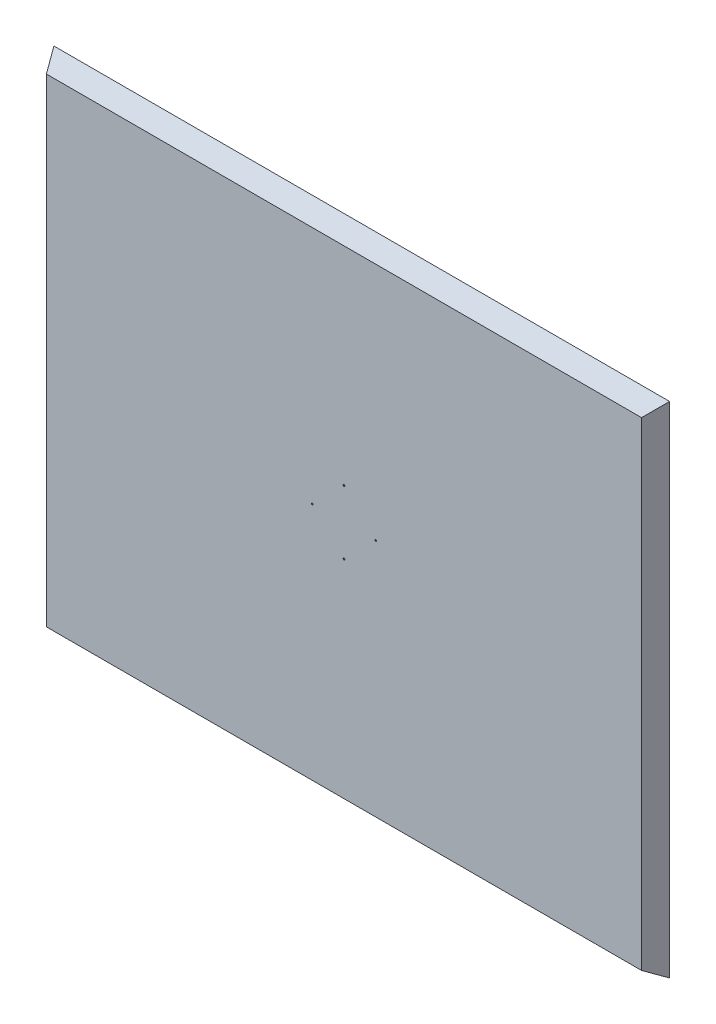
ISO-10303-21;
HEADER;
FILE_DESCRIPTION(('STEP AP214'),'2;1');
FILE_NAME('part.step','',(''),(''),'','','');
FILE_SCHEMA(('AUTOMOTIVE_DESIGN { 1 0 10303 214 1 1 1 1 }'));
ENDSEC;
DATA;
#1=APPLICATION_CONTEXT('core data for automotive mechanical design processes');
#2=APPLICATION_PROTOCOL_DEFINITION('international standard','automotive_design',2000,#1);
#3=PRODUCT_CONTEXT('',#1,'mechanical');
#4=PRODUCT('Part','Part','',(#3));
#5=PRODUCT_RELATED_PRODUCT_CATEGORY('part','',(#4));
#6=PRODUCT_DEFINITION_FORMATION('','',#4);
#7=PRODUCT_DEFINITION_CONTEXT('part definition',#1,'design');
#8=PRODUCT_DEFINITION('design','',#6,#7);
#9=PRODUCT_DEFINITION_SHAPE('','',#8);
#10=(LENGTH_UNIT() NAMED_UNIT(*) SI_UNIT(.MILLI.,.METRE.));
#11=(NAMED_UNIT(*) PLANE_ANGLE_UNIT() SI_UNIT($,.RADIAN.));
#12=(NAMED_UNIT(*) SI_UNIT($,.STERADIAN.) SOLID_ANGLE_UNIT());
#13=UNCERTAINTY_MEASURE_WITH_UNIT(LENGTH_MEASURE(1.E-05),#10,'distance_accuracy_value','');
#14=(GEOMETRIC_REPRESENTATION_CONTEXT(3) GLOBAL_UNCERTAINTY_ASSIGNED_CONTEXT((#13)) GLOBAL_UNIT_ASSIGNED_CONTEXT((#10,
#11,#12)) REPRESENTATION_CONTEXT('',''));
#15=CARTESIAN_POINT('',(0.,0.,0.));
#16=DIRECTION('',(0.,0.,1.));
#17=DIRECTION('',(1.,0.,0.));
#18=AXIS2_PLACEMENT_3D('',#15,#16,#17);
#19=CARTESIAN_POINT('',(0.,-89.415,-2181.47302049345));
#20=DIRECTION('',(0.,0.,1.));
#21=DIRECTION('',(0.,-1.,0.));
#22=AXIS2_PLACEMENT_3D('',#19,#20,#21);
#23=CYLINDRICAL_SURFACE('',#22,2.5);
#24=CARTESIAN_POINT('',(0.,-89.415,48.));
#25=DIRECTION('',(0.,0.,1.));
#26=DIRECTION('',(0.,-1.,0.));
#27=AXIS2_PLACEMENT_3D('',#24,#25,#26);
#28=CIRCLE('',#27,2.5);
#29=CARTESIAN_POINT('',(0.,-91.915,48.));
#30=VERTEX_POINT('',#29);
#31=EDGE_CURVE('E26',#30,#30,#28,.T.);
#32=ORIENTED_EDGE('',*,*,#31,.F.);
#33=EDGE_LOOP('',(#32));
#34=FACE_BOUND('',#33,.T.);
#35=CARTESIAN_POINT('',(0.,-89.415,50.));
#36=DIRECTION('',(0.,0.,1.));
#37=DIRECTION('',(1.,0.,0.));
#38=AXIS2_PLACEMENT_3D('',#35,#36,#37);
#39=CIRCLE('',#38,2.5);
#40=CARTESIAN_POINT('',(2.49999999999998,-89.415,50.));
#41=VERTEX_POINT('',#40);
#42=EDGE_CURVE('E11',#41,#41,#39,.T.);
#43=ORIENTED_EDGE('',*,*,#42,.T.);
#44=EDGE_LOOP('',(#43));
#45=FACE_BOUND('',#44,.T.);
#46=ADVANCED_FACE('F18',(#34,#45),#23,.F.);
#47=CARTESIAN_POINT('',(-89.415,0.,-2181.47302049345));
#48=DIRECTION('',(0.,0.,1.));
#49=DIRECTION('',(-1.,0.,0.));
#50=AXIS2_PLACEMENT_3D('',#47,#48,#49);
#51=CYLINDRICAL_SURFACE('',#50,2.5);
#52=CARTESIAN_POINT('',(-89.415,0.,48.));
#53=DIRECTION('',(0.,0.,1.));
#54=DIRECTION('',(-1.,0.,0.));
#55=AXIS2_PLACEMENT_3D('',#52,#53,#54);
#56=CIRCLE('',#55,2.5);
#57=CARTESIAN_POINT('',(-91.915,0.,48.));
#58=VERTEX_POINT('',#57);
#59=EDGE_CURVE('E94',#58,#58,#56,.T.);
#60=ORIENTED_EDGE('',*,*,#59,.F.);
#61=EDGE_LOOP('',(#60));
#62=FACE_BOUND('',#61,.T.);
#63=CARTESIAN_POINT('',(-89.415,0.,50.));
#64=DIRECTION('',(0.,0.,1.));
#65=DIRECTION('',(0.,-1.,0.));
#66=AXIS2_PLACEMENT_3D('',#63,#64,#65);
#67=CIRCLE('',#66,2.5);
#68=CARTESIAN_POINT('',(-89.415,-2.49999999999995,50.));
#69=VERTEX_POINT('',#68);
#70=EDGE_CURVE('E97',#69,#69,#67,.T.);
#71=ORIENTED_EDGE('',*,*,#70,.T.);
#72=EDGE_LOOP('',(#71));
#73=FACE_BOUND('',#72,.T.);
#74=ADVANCED_FACE('F108',(#62,#73),#51,.F.);
#75=CARTESIAN_POINT('',(0.,89.415,-2181.47302049345));
#76=DIRECTION('',(0.,0.,1.));
#77=DIRECTION('',(0.,1.,0.));
#78=AXIS2_PLACEMENT_3D('',#75,#76,#77);
#79=CYLINDRICAL_SURFACE('',#78,2.5);
#80=CARTESIAN_POINT('',(0.,89.415,48.));
#81=DIRECTION('',(0.,0.,1.));
#82=DIRECTION('',(0.,1.,0.));
#83=AXIS2_PLACEMENT_3D('',#80,#81,#82);
#84=CIRCLE('',#83,2.5);
#85=CARTESIAN_POINT('',(0.,91.915,48.));
#86=VERTEX_POINT('',#85);
#87=EDGE_CURVE('E87',#86,#86,#84,.T.);
#88=ORIENTED_EDGE('',*,*,#87,.F.);
#89=EDGE_LOOP('',(#88));
#90=FACE_BOUND('',#89,.T.);
#91=CARTESIAN_POINT('',(0.,89.415,50.));
#92=DIRECTION('',(0.,0.,1.));
#93=DIRECTION('',(-1.,0.,0.));
#94=AXIS2_PLACEMENT_3D('',#91,#92,#93);
#95=CIRCLE('',#94,2.5);
#96=CARTESIAN_POINT('',(-2.49999999999999,89.415,50.));
#97=VERTEX_POINT('',#96);
#98=EDGE_CURVE('E90',#97,#97,#95,.T.);
#99=ORIENTED_EDGE('',*,*,#98,.T.);
#100=EDGE_LOOP('',(#99));
#101=FACE_BOUND('',#100,.T.);
#102=ADVANCED_FACE('F247',(#90,#101),#79,.F.);
#103=CARTESIAN_POINT('',(-837.5,0.,50.));
#104=DIRECTION('',(-0.866025403784439,0.,0.5));
#105=DIRECTION('',(0.5,0.,0.866025403784439));
#106=AXIS2_PLACEMENT_3D('',#103,#104,#105);
#107=PLANE('',#106);
#108=DIRECTION('',(0.,1.,0.));
#109=VECTOR('',#108,1.);
#110=CARTESIAN_POINT('',(-866.367513459481,0.,0.));
#111=LINE('',#110,#109);
#112=CARTESIAN_POINT('',(-866.367513459481,702.602513459481,0.));
#113=VERTEX_POINT('',#112);
#114=CARTESIAN_POINT('',(-866.367513459481,-702.602513459481,0.));
#115=VERTEX_POINT('',#114);
#116=EDGE_CURVE('E137',#113,#115,#111,.F.);
#117=ORIENTED_EDGE('',*,*,#116,.T.);
#118=DIRECTION('',(-0.447213595499958,-0.447213595499958,-0.774596669241483));
#119=VECTOR('',#118,1.);
#120=CARTESIAN_POINT('',(-670.,-506.235,340.118510267787));
#121=LINE('',#120,#119);
#122=CARTESIAN_POINT('',(-837.5,-673.735,50.));
#123=VERTEX_POINT('',#122);
#124=EDGE_CURVE('E74',#123,#115,#121,.T.);
#125=ORIENTED_EDGE('',*,*,#124,.F.);
#126=DIRECTION('',(0.,1.,0.));
#127=VECTOR('',#126,1.);
#128=CARTESIAN_POINT('',(-837.5,0.,50.));
#129=LINE('',#128,#127);
#130=CARTESIAN_POINT('',(-837.5,673.735,50.));
#131=VERTEX_POINT('',#130);
#132=EDGE_CURVE('E59',#131,#123,#129,.F.);
#133=ORIENTED_EDGE('',*,*,#132,.F.);
#134=DIRECTION('',(-0.447213595499958,0.447213595499958,-0.774596669241483));
#135=VECTOR('',#134,1.);
#136=CARTESIAN_POINT('',(-702.753,538.988,283.388650167484));
#137=LINE('',#136,#135);
#138=EDGE_CURVE('E80',#131,#113,#137,.T.);
#139=ORIENTED_EDGE('',*,*,#138,.T.);
#140=EDGE_LOOP('',(#117,#125,#133,#139));
#141=FACE_BOUND('',#140,.T.);
#142=ADVANCED_FACE('F183',(#141),#107,.T.);
#143=CARTESIAN_POINT('',(0.,-673.735,50.));
#144=DIRECTION('',(0.,-0.866025403784439,0.5));
#145=DIRECTION('',(0.,-0.5,-0.866025403784439));
#146=AXIS2_PLACEMENT_3D('',#143,#144,#145);
#147=PLANE('',#146);
#148=DIRECTION('',(-1.,0.,0.));
#149=VECTOR('',#148,1.);
#150=CARTESIAN_POINT('',(0.,-702.602513459481,0.));
#151=LINE('',#150,#149);
#152=CARTESIAN_POINT('',(866.367513459481,-702.602513459481,0.));
#153=VERTEX_POINT('',#152);
#154=EDGE_CURVE('E70',#115,#153,#151,.F.);
#155=ORIENTED_EDGE('',*,*,#154,.T.);
#156=DIRECTION('',(0.447213595499958,-0.447213595499958,-0.774596669241483));
#157=VECTOR('',#156,1.);
#158=CARTESIAN_POINT('',(702.753,-538.988,283.388650167484));
#159=LINE('',#158,#157);
#160=CARTESIAN_POINT('',(837.5,-673.735,50.));
#161=VERTEX_POINT('',#160);
#162=EDGE_CURVE('E66',#161,#153,#159,.T.);
#163=ORIENTED_EDGE('',*,*,#162,.F.);
#164=DIRECTION('',(-1.,0.,0.));
#165=VECTOR('',#164,1.);
#166=CARTESIAN_POINT('',(0.,-673.735,50.));
#167=LINE('',#166,#165);
#168=EDGE_CURVE('E52',#123,#161,#167,.F.);
#169=ORIENTED_EDGE('',*,*,#168,.F.);
#170=ORIENTED_EDGE('',*,*,#124,.T.);
#171=EDGE_LOOP('',(#155,#163,#169,#170));
#172=FACE_BOUND('',#171,.T.);
#173=ADVANCED_FACE('F67',(#172),#147,.T.);
#174=CARTESIAN_POINT('',(837.5,0.,50.));
#175=DIRECTION('',(0.866025403784439,0.,0.5));
#176=DIRECTION('',(0.5,0.,-0.866025403784439));
#177=AXIS2_PLACEMENT_3D('',#174,#175,#176);
#178=PLANE('',#177);
#179=DIRECTION('',(0.,-1.,0.));
#180=VECTOR('',#179,1.);
#181=CARTESIAN_POINT('',(866.367513459481,0.,0.));
#182=LINE('',#181,#180);
#183=CARTESIAN_POINT('',(866.367513459481,702.602513459481,0.));
#184=VERTEX_POINT('',#183);
#185=EDGE_CURVE('E173',#153,#184,#182,.F.);
#186=ORIENTED_EDGE('',*,*,#185,.T.);
#187=DIRECTION('',(0.447213595499958,0.447213595499958,-0.774596669241483));
#188=VECTOR('',#187,1.);
#189=CARTESIAN_POINT('',(670.,506.235,340.118510267787));
#190=LINE('',#189,#188);
#191=CARTESIAN_POINT('',(837.5,673.735,50.));
#192=VERTEX_POINT('',#191);
#193=EDGE_CURVE('E75',#192,#184,#190,.T.);
#194=ORIENTED_EDGE('',*,*,#193,.F.);
#195=DIRECTION('',(0.,-1.,0.));
#196=VECTOR('',#195,1.);
#197=CARTESIAN_POINT('',(837.5,0.,50.));
#198=LINE('',#197,#196);
#199=EDGE_CURVE('E56',#161,#192,#198,.F.);
#200=ORIENTED_EDGE('',*,*,#199,.F.);
#201=ORIENTED_EDGE('',*,*,#162,.T.);
#202=EDGE_LOOP('',(#186,#194,#200,#201));
#203=FACE_BOUND('',#202,.T.);
#204=ADVANCED_FACE('F77',(#203),#178,.T.);
#205=CARTESIAN_POINT('',(0.,673.735,50.));
#206=DIRECTION('',(0.,0.866025403784439,0.5));
#207=DIRECTION('',(0.,-0.5,0.866025403784439));
#208=AXIS2_PLACEMENT_3D('',#205,#206,#207);
#209=PLANE('',#208);
#210=DIRECTION('',(1.,0.,0.));
#211=VECTOR('',#210,1.);
#212=CARTESIAN_POINT('',(0.,702.602513459481,0.));
#213=LINE('',#212,#211);
#214=EDGE_CURVE('E83',#184,#113,#213,.F.);
#215=ORIENTED_EDGE('',*,*,#214,.T.);
#216=ORIENTED_EDGE('',*,*,#138,.F.);
#217=DIRECTION('',(1.,0.,0.));
#218=VECTOR('',#217,1.);
#219=CARTESIAN_POINT('',(0.,673.735,50.));
#220=LINE('',#219,#218);
#221=EDGE_CURVE('E42',#192,#131,#220,.F.);
#222=ORIENTED_EDGE('',*,*,#221,.F.);
#223=ORIENTED_EDGE('',*,*,#193,.T.);
#224=EDGE_LOOP('',(#215,#216,#222,#223));
#225=FACE_BOUND('',#224,.T.);
#226=ADVANCED_FACE('F114',(#225),#209,.T.);
#227=CARTESIAN_POINT('',(0.,0.,50.));
#228=DIRECTION('',(0.,0.,1.));
#229=DIRECTION('',(1.,0.,0.));
#230=AXIS2_PLACEMENT_3D('',#227,#228,#229);
#231=PLANE('',#230);
#232=ORIENTED_EDGE('',*,*,#42,.F.);
#233=EDGE_LOOP('',(#232));
#234=FACE_BOUND('',#233,.T.);
#235=ORIENTED_EDGE('',*,*,#70,.F.);
#236=EDGE_LOOP('',(#235));
#237=FACE_BOUND('',#236,.T.);
#238=ORIENTED_EDGE('',*,*,#98,.F.);
#239=EDGE_LOOP('',(#238));
#240=FACE_BOUND('',#239,.T.);
#241=CARTESIAN_POINT('',(89.415,0.,50.));
#242=DIRECTION('',(0.,0.,1.));
#243=DIRECTION('',(0.,1.,0.));
#244=AXIS2_PLACEMENT_3D('',#241,#242,#243);
#245=CIRCLE('',#244,2.5);
#246=CARTESIAN_POINT('',(89.415,2.5,50.));
#247=VERTEX_POINT('',#246);
#248=EDGE_CURVE('E122',#247,#247,#245,.T.);
#249=ORIENTED_EDGE('',*,*,#248,.F.);
#250=EDGE_LOOP('',(#249));
#251=FACE_BOUND('',#250,.T.);
#252=ORIENTED_EDGE('',*,*,#132,.T.);
#253=ORIENTED_EDGE('',*,*,#168,.T.);
#254=ORIENTED_EDGE('',*,*,#199,.T.);
#255=ORIENTED_EDGE('',*,*,#221,.T.);
#256=EDGE_LOOP('',(#252,#253,#254,#255));
#257=FACE_BOUND('',#256,.T.);
#258=ADVANCED_FACE('F54',(#234,#237,#240,#251,#257),#231,.T.);
#259=CARTESIAN_POINT('',(0.,0.,0.));
#260=DIRECTION('',(0.,0.,1.));
#261=DIRECTION('',(1.,0.,0.));
#262=AXIS2_PLACEMENT_3D('',#259,#260,#261);
#263=PLANE('',#262);
#264=DIRECTION('',(1.,0.,0.));
#265=VECTOR('',#264,1.);
#266=CARTESIAN_POINT('',(0.,700.293112382723,0.));
#267=LINE('',#266,#265);
#268=CARTESIAN_POINT('',(864.058112382723,700.293112382723,0.));
#269=VERTEX_POINT('',#268);
#270=CARTESIAN_POINT('',(-864.058112382723,700.293112382723,0.));
#271=VERTEX_POINT('',#270);
#272=EDGE_CURVE('E143',#269,#271,#267,.F.);
#273=ORIENTED_EDGE('',*,*,#272,.T.);
#274=DIRECTION('',(0.,1.,0.));
#275=VECTOR('',#274,1.);
#276=CARTESIAN_POINT('',(-864.058112382723,0.,0.));
#277=LINE('',#276,#275);
#278=CARTESIAN_POINT('',(-864.058112382723,-700.293112382723,0.));
#279=VERTEX_POINT('',#278);
#280=EDGE_CURVE('E131',#271,#279,#277,.F.);
#281=ORIENTED_EDGE('',*,*,#280,.T.);
#282=DIRECTION('',(-1.,0.,0.));
#283=VECTOR('',#282,1.);
#284=CARTESIAN_POINT('',(0.,-700.293112382723,0.));
#285=LINE('',#284,#283);
#286=CARTESIAN_POINT('',(864.058112382723,-700.293112382723,0.));
#287=VERTEX_POINT('',#286);
#288=EDGE_CURVE('E161',#279,#287,#285,.F.);
#289=ORIENTED_EDGE('',*,*,#288,.T.);
#290=DIRECTION('',(0.,-1.,0.));
#291=VECTOR('',#290,1.);
#292=CARTESIAN_POINT('',(864.058112382723,0.,0.));
#293=LINE('',#292,#291);
#294=EDGE_CURVE('E33',#287,#269,#293,.F.);
#295=ORIENTED_EDGE('',*,*,#294,.T.);
#296=EDGE_LOOP('',(#273,#281,#289,#295));
#297=FACE_BOUND('',#296,.T.);
#298=ORIENTED_EDGE('',*,*,#116,.F.);
#299=ORIENTED_EDGE('',*,*,#214,.F.);
#300=ORIENTED_EDGE('',*,*,#185,.F.);
#301=ORIENTED_EDGE('',*,*,#154,.F.);
#302=EDGE_LOOP('',(#298,#299,#300,#301));
#303=FACE_BOUND('',#302,.T.);
#304=ADVANCED_FACE('F113',(#297,#303),#263,.F.);
#305=CARTESIAN_POINT('',(-835.767949192431,0.,49.));
#306=DIRECTION('',(-0.866025403784439,0.,0.5));
#307=DIRECTION('',(0.5,0.,0.866025403784439));
#308=AXIS2_PLACEMENT_3D('',#305,#306,#307);
#309=PLANE('',#308);
#310=ORIENTED_EDGE('',*,*,#280,.F.);
#311=DIRECTION('',(-0.447213595499958,0.447213595499958,-0.774596669241483));
#312=VECTOR('',#311,1.);
#313=CARTESIAN_POINT('',(-701.367359353945,537.602359353945,281.788650167484));
#314=LINE('',#313,#312);
#315=CARTESIAN_POINT('',(-836.345299461621,672.580299461621,48.));
#316=VERTEX_POINT('',#315);
#317=EDGE_CURVE('E144',#316,#271,#314,.T.);
#318=ORIENTED_EDGE('',*,*,#317,.F.);
#319=DIRECTION('',(0.,1.,0.));
#320=VECTOR('',#319,1.);
#321=CARTESIAN_POINT('',(-836.345299461621,0.,48.));
#322=LINE('',#321,#320);
#323=CARTESIAN_POINT('',(-836.345299461621,-672.580299461621,48.));
#324=VERTEX_POINT('',#323);
#325=EDGE_CURVE('E139',#316,#324,#322,.F.);
#326=ORIENTED_EDGE('',*,*,#325,.T.);
#327=DIRECTION('',(-0.447213595499958,-0.447213595499958,-0.774596669241483));
#328=VECTOR('',#327,1.);
#329=CARTESIAN_POINT('',(-668.614359353945,-504.849359353945,338.518510267787));
#330=LINE('',#329,#328);
#331=EDGE_CURVE('E134',#324,#279,#330,.T.);
#332=ORIENTED_EDGE('',*,*,#331,.T.);
#333=EDGE_LOOP('',(#310,#318,#326,#332));
#334=FACE_BOUND('',#333,.T.);
#335=ADVANCED_FACE('F217',(#334),#309,.F.);
#336=CARTESIAN_POINT('',(0.,-672.002949192431,49.));
#337=DIRECTION('',(0.,-0.866025403784439,0.5));
#338=DIRECTION('',(0.,-0.5,-0.866025403784439));
#339=AXIS2_PLACEMENT_3D('',#336,#337,#338);
#340=PLANE('',#339);
#341=ORIENTED_EDGE('',*,*,#288,.F.);
#342=ORIENTED_EDGE('',*,*,#331,.F.);
#343=DIRECTION('',(-1.,0.,0.));
#344=VECTOR('',#343,1.);
#345=CARTESIAN_POINT('',(0.,-672.580299461621,48.));
#346=LINE('',#345,#344);
#347=CARTESIAN_POINT('',(836.345299461621,-672.580299461621,48.));
#348=VERTEX_POINT('',#347);
#349=EDGE_CURVE('E142',#324,#348,#346,.F.);
#350=ORIENTED_EDGE('',*,*,#349,.T.);
#351=DIRECTION('',(0.447213595499958,-0.447213595499958,-0.774596669241483));
#352=VECTOR('',#351,1.);
#353=CARTESIAN_POINT('',(701.367359353945,-537.602359353945,281.788650167484));
#354=LINE('',#353,#352);
#355=EDGE_CURVE('E138',#348,#287,#354,.T.);
#356=ORIENTED_EDGE('',*,*,#355,.T.);
#357=EDGE_LOOP('',(#341,#342,#350,#356));
#358=FACE_BOUND('',#357,.T.);
#359=ADVANCED_FACE('F218',(#358),#340,.F.);
#360=CARTESIAN_POINT('',(835.767949192431,0.,49.));
#361=DIRECTION('',(0.866025403784439,0.,0.5));
#362=DIRECTION('',(0.5,0.,-0.866025403784439));
#363=AXIS2_PLACEMENT_3D('',#360,#361,#362);
#364=PLANE('',#363);
#365=ORIENTED_EDGE('',*,*,#294,.F.);
#366=ORIENTED_EDGE('',*,*,#355,.F.);
#367=DIRECTION('',(0.,-1.,0.));
#368=VECTOR('',#367,1.);
#369=CARTESIAN_POINT('',(836.345299461621,0.,48.));
#370=LINE('',#369,#368);
#371=CARTESIAN_POINT('',(836.345299461621,672.580299461621,48.));
#372=VERTEX_POINT('',#371);
#373=EDGE_CURVE('E152',#348,#372,#370,.F.);
#374=ORIENTED_EDGE('',*,*,#373,.T.);
#375=DIRECTION('',(0.447213595499958,0.447213595499958,-0.774596669241483));
#376=VECTOR('',#375,1.);
#377=CARTESIAN_POINT('',(668.614359353945,504.849359353945,338.518510267787));
#378=LINE('',#377,#376);
#379=EDGE_CURVE('E147',#372,#269,#378,.T.);
#380=ORIENTED_EDGE('',*,*,#379,.T.);
#381=EDGE_LOOP('',(#365,#366,#374,#380));
#382=FACE_BOUND('',#381,.T.);
#383=ADVANCED_FACE('F224',(#382),#364,.F.);
#384=CARTESIAN_POINT('',(0.,672.002949192431,49.));
#385=DIRECTION('',(0.,0.866025403784439,0.5));
#386=DIRECTION('',(0.,-0.5,0.866025403784439));
#387=AXIS2_PLACEMENT_3D('',#384,#385,#386);
#388=PLANE('',#387);
#389=ORIENTED_EDGE('',*,*,#272,.F.);
#390=ORIENTED_EDGE('',*,*,#379,.F.);
#391=DIRECTION('',(1.,0.,0.));
#392=VECTOR('',#391,1.);
#393=CARTESIAN_POINT('',(0.,672.580299461621,48.));
#394=LINE('',#393,#392);
#395=EDGE_CURVE('E148',#372,#316,#394,.F.);
#396=ORIENTED_EDGE('',*,*,#395,.T.);
#397=ORIENTED_EDGE('',*,*,#317,.T.);
#398=EDGE_LOOP('',(#389,#390,#396,#397));
#399=FACE_BOUND('',#398,.T.);
#400=ADVANCED_FACE('F223',(#399),#388,.F.);
#401=CARTESIAN_POINT('',(0.,0.,48.));
#402=DIRECTION('',(0.,0.,1.));
#403=DIRECTION('',(1.,0.,0.));
#404=AXIS2_PLACEMENT_3D('',#401,#402,#403);
#405=PLANE('',#404);
#406=ORIENTED_EDGE('',*,*,#31,.T.);
#407=EDGE_LOOP('',(#406));
#408=FACE_BOUND('',#407,.T.);
#409=ORIENTED_EDGE('',*,*,#59,.T.);
#410=EDGE_LOOP('',(#409));
#411=FACE_BOUND('',#410,.T.);
#412=ORIENTED_EDGE('',*,*,#87,.T.);
#413=EDGE_LOOP('',(#412));
#414=FACE_BOUND('',#413,.T.);
#415=CARTESIAN_POINT('',(89.415,0.,48.));
#416=DIRECTION('',(0.,0.,1.));
#417=DIRECTION('',(1.,0.,0.));
#418=AXIS2_PLACEMENT_3D('',#415,#416,#417);
#419=CIRCLE('',#418,2.5);
#420=CARTESIAN_POINT('',(91.915,0.,48.));
#421=VERTEX_POINT('',#420);
#422=EDGE_CURVE('E125',#421,#421,#419,.T.);
#423=ORIENTED_EDGE('',*,*,#422,.T.);
#424=EDGE_LOOP('',(#423));
#425=FACE_BOUND('',#424,.T.);
#426=ORIENTED_EDGE('',*,*,#325,.F.);
#427=ORIENTED_EDGE('',*,*,#395,.F.);
#428=ORIENTED_EDGE('',*,*,#373,.F.);
#429=ORIENTED_EDGE('',*,*,#349,.F.);
#430=EDGE_LOOP('',(#426,#427,#428,#429));
#431=FACE_BOUND('',#430,.T.);
#432=ADVANCED_FACE('F103',(#408,#411,#414,#425,#431),#405,.F.);
#433=CARTESIAN_POINT('',(89.415,0.,-2181.47302049345));
#434=DIRECTION('',(0.,0.,1.));
#435=DIRECTION('',(1.,0.,0.));
#436=AXIS2_PLACEMENT_3D('',#433,#434,#435);
#437=CYLINDRICAL_SURFACE('',#436,2.5);
#438=ORIENTED_EDGE('',*,*,#422,.F.);
#439=EDGE_LOOP('',(#438));
#440=FACE_BOUND('',#439,.T.);
#441=ORIENTED_EDGE('',*,*,#248,.T.);
#442=EDGE_LOOP('',(#441));
#443=FACE_BOUND('',#442,.T.);
#444=ADVANCED_FACE('F237',(#440,#443),#437,.F.);
#445=CLOSED_SHELL('',(#46,#74,#102,#142,#173,#204,#226,#258,#304,#335,#359,#383,#400,#432,#444));
#446=MANIFOLD_SOLID_BREP('B1',#445);
#447=ADVANCED_BREP_SHAPE_REPRESENTATION('',(#18,#446),#14);
#448=SHAPE_DEFINITION_REPRESENTATION(#9,#447);
ENDSEC;
END-ISO-10303-21;
